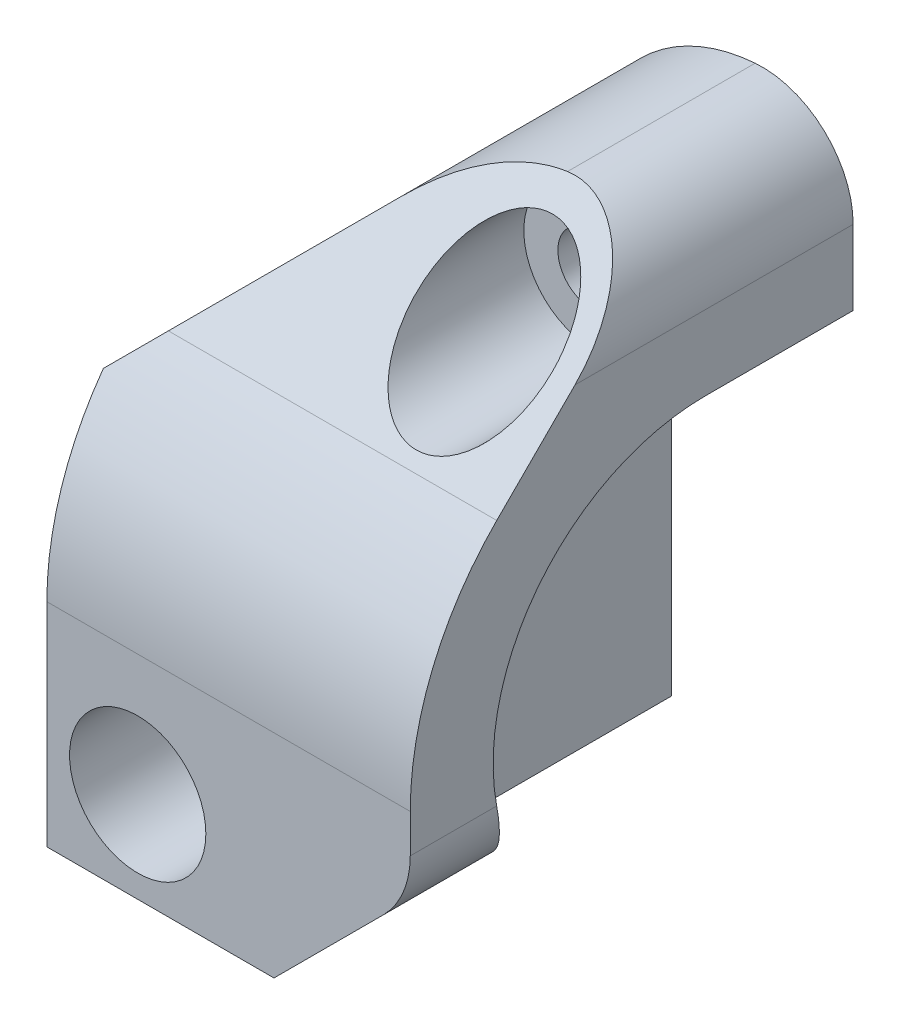
ISO-10303-21;
HEADER;
FILE_DESCRIPTION(('STEP AP214'),'2;1');
FILE_NAME('part.step','',(''),(''),'','','');
FILE_SCHEMA(('AUTOMOTIVE_DESIGN { 1 0 10303 214 1 1 1 1 }'));
ENDSEC;
DATA;
#1=APPLICATION_CONTEXT('core data for automotive mechanical design processes');
#2=APPLICATION_PROTOCOL_DEFINITION('international standard','automotive_design',2000,#1);
#3=PRODUCT_CONTEXT('',#1,'mechanical');
#4=PRODUCT('Part','Part','',(#3));
#5=PRODUCT_RELATED_PRODUCT_CATEGORY('part','',(#4));
#6=PRODUCT_DEFINITION_FORMATION('','',#4);
#7=PRODUCT_DEFINITION_CONTEXT('part definition',#1,'design');
#8=PRODUCT_DEFINITION('design','',#6,#7);
#9=PRODUCT_DEFINITION_SHAPE('','',#8);
#10=(LENGTH_UNIT() NAMED_UNIT(*) SI_UNIT(.MILLI.,.METRE.));
#11=(NAMED_UNIT(*) PLANE_ANGLE_UNIT() SI_UNIT($,.RADIAN.));
#12=(NAMED_UNIT(*) SI_UNIT($,.STERADIAN.) SOLID_ANGLE_UNIT());
#13=UNCERTAINTY_MEASURE_WITH_UNIT(LENGTH_MEASURE(1.E-05),#10,'distance_accuracy_value','');
#14=(GEOMETRIC_REPRESENTATION_CONTEXT(3) GLOBAL_UNCERTAINTY_ASSIGNED_CONTEXT((#13)) GLOBAL_UNIT_ASSIGNED_CONTEXT((#10,
#11,#12)) REPRESENTATION_CONTEXT('',''));
#15=CARTESIAN_POINT('',(0.,0.,0.));
#16=DIRECTION('',(0.,0.,1.));
#17=DIRECTION('',(1.,0.,0.));
#18=AXIS2_PLACEMENT_3D('',#15,#16,#17);
#19=CARTESIAN_POINT('',(0.,0.,8.5));
#20=DIRECTION('',(0.,0.,1.));
#21=DIRECTION('',(1.,0.,0.));
#22=AXIS2_PLACEMENT_3D('',#19,#20,#21);
#23=PLANE('',#22);
#24=CARTESIAN_POINT('',(79.,22.,8.5));
#25=DIRECTION('',(0.,0.,1.));
#26=DIRECTION('',(1.,0.,0.));
#27=AXIS2_PLACEMENT_3D('',#24,#25,#26);
#28=CIRCLE('',#27,1.49999999999999);
#29=CARTESIAN_POINT('',(80.5,22.,8.5));
#30=VERTEX_POINT('',#29);
#31=EDGE_CURVE('E269',#30,#30,#28,.F.);
#32=ORIENTED_EDGE('',*,*,#31,.F.);
#33=EDGE_LOOP('',(#32));
#34=FACE_BOUND('',#33,.T.);
#35=CARTESIAN_POINT('',(71.,4.,8.5));
#36=DIRECTION('',(0.,0.,1.));
#37=DIRECTION('',(1.,0.,0.));
#38=AXIS2_PLACEMENT_3D('',#35,#36,#37);
#39=CIRCLE('',#38,1.49999999999999);
#40=CARTESIAN_POINT('',(72.5,4.,8.5));
#41=VERTEX_POINT('',#40);
#42=EDGE_CURVE('E275',#41,#41,#39,.F.);
#43=ORIENTED_EDGE('',*,*,#42,.F.);
#44=EDGE_LOOP('',(#43));
#45=FACE_BOUND('',#44,.T.);
#46=CARTESIAN_POINT('',(79.3137084989848,18.,8.5));
#47=DIRECTION('',(0.,0.,1.));
#48=DIRECTION('',(1.,0.,0.));
#49=AXIS2_PLACEMENT_3D('',#46,#47,#48);
#50=CIRCLE('',#49,8.);
#51=CARTESIAN_POINT('',(73.6568542494924,23.6568542494924,8.5));
#52=VERTEX_POINT('',#51);
#53=CARTESIAN_POINT('',(78.6862915010153,25.975358795105,8.5));
#54=VERTEX_POINT('',#53);
#55=EDGE_CURVE('E253',#52,#54,#50,.F.);
#56=ORIENTED_EDGE('',*,*,#55,.T.);
#57=CARTESIAN_POINT('',(79.,21.9876793975525,8.5));
#58=DIRECTION('',(0.,0.,1.));
#59=DIRECTION('',(1.,0.,0.));
#60=AXIS2_PLACEMENT_3D('',#57,#58,#59);
#61=CIRCLE('',#60,4.);
#62=CARTESIAN_POINT('',(83.,21.9876793975525,8.5));
#63=VERTEX_POINT('',#62);
#64=EDGE_CURVE('E287',#54,#63,#61,.F.);
#65=ORIENTED_EDGE('',*,*,#64,.T.);
#66=DIRECTION('',(0.,-1.,0.));
#67=VECTOR('',#66,1.);
#68=CARTESIAN_POINT('',(83.,0.,8.5));
#69=LINE('',#68,#67);
#70=CARTESIAN_POINT('',(83.,18.7,8.5));
#71=VERTEX_POINT('',#70);
#72=EDGE_CURVE('E266',#63,#71,#69,.T.);
#73=ORIENTED_EDGE('',*,*,#72,.T.);
#74=DIRECTION('',(1.,0.,0.));
#75=VECTOR('',#74,1.);
#76=CARTESIAN_POINT('',(117.188302092967,18.7,8.5));
#77=LINE('',#76,#75);
#78=CARTESIAN_POINT('',(75.,18.7,8.5));
#79=VERTEX_POINT('',#78);
#80=EDGE_CURVE('E252',#79,#71,#77,.T.);
#81=ORIENTED_EDGE('',*,*,#80,.F.);
#82=DIRECTION('',(0.,-1.,0.));
#83=VECTOR('',#82,1.);
#84=CARTESIAN_POINT('',(75.,21.,8.5));
#85=LINE('',#84,#83);
#86=CARTESIAN_POINT('',(75.,0.,8.5));
#87=VERTEX_POINT('',#86);
#88=EDGE_CURVE('E261',#79,#87,#85,.T.);
#89=ORIENTED_EDGE('',*,*,#88,.T.);
#90=DIRECTION('',(-1.,0.,0.));
#91=VECTOR('',#90,1.);
#92=CARTESIAN_POINT('',(117.188302092967,0.,8.5));
#93=LINE('',#92,#91);
#94=CARTESIAN_POINT('',(67.,0.,8.5));
#95=VERTEX_POINT('',#94);
#96=EDGE_CURVE('E265',#87,#95,#93,.T.);
#97=ORIENTED_EDGE('',*,*,#96,.T.);
#98=DIRECTION('',(0.,1.,0.));
#99=VECTOR('',#98,1.);
#100=CARTESIAN_POINT('',(67.,0.,8.5));
#101=LINE('',#100,#99);
#102=CARTESIAN_POINT('',(67.,17.,8.5));
#103=VERTEX_POINT('',#102);
#104=EDGE_CURVE('E262',#95,#103,#101,.T.);
#105=ORIENTED_EDGE('',*,*,#104,.T.);
#106=DIRECTION('',(-0.707106781186549,-0.707106781186546,0.));
#107=VECTOR('',#106,1.);
#108=CARTESIAN_POINT('',(67.,17.,8.5));
#109=LINE('',#108,#107);
#110=EDGE_CURVE('E257',#103,#52,#109,.F.);
#111=ORIENTED_EDGE('',*,*,#110,.T.);
#112=EDGE_LOOP('',(#56,#65,#73,#81,#89,#97,#105,#111));
#113=FACE_BOUND('',#112,.T.);
#114=ADVANCED_FACE('F44',(#34,#45,#113),#23,.F.);
#115=CARTESIAN_POINT('',(79.,22.,2.));
#116=DIRECTION('',(0.,0.,-1.));
#117=DIRECTION('',(-1.,0.,0.));
#118=AXIS2_PLACEMENT_3D('',#115,#116,#117);
#119=CYLINDRICAL_SURFACE('',#118,1.49999999999999);
#120=ORIENTED_EDGE('',*,*,#31,.T.);
#121=EDGE_LOOP('',(#120));
#122=FACE_BOUND('',#121,.T.);
#123=CARTESIAN_POINT('',(79.,22.,16.));
#124=DIRECTION('',(0.,0.,1.));
#125=DIRECTION('',(1.,0.,0.));
#126=AXIS2_PLACEMENT_3D('',#123,#124,#125);
#127=CIRCLE('',#126,1.49999999999999);
#128=CARTESIAN_POINT('',(80.5,22.,16.));
#129=VERTEX_POINT('',#128);
#130=EDGE_CURVE('E231',#129,#129,#127,.F.);
#131=ORIENTED_EDGE('',*,*,#130,.F.);
#132=EDGE_LOOP('',(#131));
#133=FACE_BOUND('',#132,.T.);
#134=ADVANCED_FACE('F343',(#122,#133),#119,.F.);
#135=CARTESIAN_POINT('',(71.,4.,2.));
#136=DIRECTION('',(0.,0.,-1.));
#137=DIRECTION('',(-1.,0.,0.));
#138=AXIS2_PLACEMENT_3D('',#135,#136,#137);
#139=CYLINDRICAL_SURFACE('',#138,1.49999999999999);
#140=ORIENTED_EDGE('',*,*,#42,.T.);
#141=EDGE_LOOP('',(#140));
#142=FACE_BOUND('',#141,.T.);
#143=CARTESIAN_POINT('',(71.,4.,16.));
#144=DIRECTION('',(0.,0.,1.));
#145=DIRECTION('',(1.,0.,0.));
#146=AXIS2_PLACEMENT_3D('',#143,#144,#145);
#147=CIRCLE('',#146,1.49999999999999);
#148=CARTESIAN_POINT('',(72.5,4.,16.));
#149=VERTEX_POINT('',#148);
#150=EDGE_CURVE('E227',#149,#149,#147,.F.);
#151=ORIENTED_EDGE('',*,*,#150,.F.);
#152=EDGE_LOOP('',(#151));
#153=FACE_BOUND('',#152,.T.);
#154=ADVANCED_FACE('F330',(#142,#153),#139,.F.);
#155=CARTESIAN_POINT('',(83.,0.,0.));
#156=DIRECTION('',(1.,0.,0.));
#157=DIRECTION('',(0.,0.,-1.));
#158=AXIS2_PLACEMENT_3D('',#155,#156,#157);
#159=PLANE('',#158);
#160=DIRECTION('',(0.,1.,0.));
#161=VECTOR('',#160,1.);
#162=CARTESIAN_POINT('',(83.,0.,28.));
#163=LINE('',#162,#161);
#164=CARTESIAN_POINT('',(83.,7.6568542494924,28.));
#165=VERTEX_POINT('',#164);
#166=CARTESIAN_POINT('',(83.,9.34999999999999,28.));
#167=VERTEX_POINT('',#166);
#168=EDGE_CURVE('E192',#165,#167,#163,.T.);
#169=ORIENTED_EDGE('',*,*,#168,.F.);
#170=DIRECTION('',(0.,0.,1.));
#171=VECTOR('',#170,1.);
#172=CARTESIAN_POINT('',(83.,7.6568542494924,0.));
#173=LINE('',#172,#171);
#174=CARTESIAN_POINT('',(83.,7.6568542494924,24.1954204617047));
#175=VERTEX_POINT('',#174);
#176=EDGE_CURVE('E303',#165,#175,#173,.F.);
#177=ORIENTED_EDGE('',*,*,#176,.T.);
#178=CARTESIAN_POINT('',(83.,9.34999999999999,15.));
#179=DIRECTION('',(1.,0.,0.));
#180=DIRECTION('',(0.,0.,-1.));
#181=AXIS2_PLACEMENT_3D('',#178,#179,#180);
#182=CIRCLE('',#181,9.35);
#183=CARTESIAN_POINT('',(83.,18.7,15.));
#184=VERTEX_POINT('',#183);
#185=EDGE_CURVE('E195',#184,#175,#182,.T.);
#186=ORIENTED_EDGE('',*,*,#185,.F.);
#187=DIRECTION('',(0.,0.,-1.));
#188=VECTOR('',#187,1.);
#189=CARTESIAN_POINT('',(83.,18.7,15.));
#190=LINE('',#189,#188);
#191=EDGE_CURVE('E190',#184,#71,#190,.T.);
#192=ORIENTED_EDGE('',*,*,#191,.T.);
#193=ORIENTED_EDGE('',*,*,#72,.F.);
#194=DIRECTION('',(0.,0.,-1.));
#195=VECTOR('',#194,1.);
#196=CARTESIAN_POINT('',(83.,21.9876793975525,0.));
#197=LINE('',#196,#195);
#198=CARTESIAN_POINT('',(83.,21.9876793975525,20.7470969132977));
#199=VERTEX_POINT('',#198);
#200=EDGE_CURVE('E178',#63,#199,#197,.F.);
#201=ORIENTED_EDGE('',*,*,#200,.T.);
#202=DIRECTION('',(0.,0.707106781186549,-0.707106781186546));
#203=VECTOR('',#202,1.);
#204=CARTESIAN_POINT('',(83.,21.3673881554251,21.3673881554252));
#205=LINE('',#204,#203);
#206=CARTESIAN_POINT('',(83.,18.5423881554251,24.1923881554251));
#207=VERTEX_POINT('',#206);
#208=EDGE_CURVE('E165',#207,#199,#205,.T.);
#209=ORIENTED_EDGE('',*,*,#208,.F.);
#210=CARTESIAN_POINT('',(83.,9.34999999999999,15.));
#211=DIRECTION('',(1.,0.,0.));
#212=DIRECTION('',(0.,0.,-1.));
#213=AXIS2_PLACEMENT_3D('',#210,#211,#212);
#214=CIRCLE('',#213,13.);
#215=EDGE_CURVE('E154',#167,#207,#214,.F.);
#216=ORIENTED_EDGE('',*,*,#215,.F.);
#217=EDGE_LOOP('',(#169,#177,#186,#192,#193,#201,#209,#216));
#218=FACE_BOUND('',#217,.T.);
#219=ADVANCED_FACE('F175',(#218),#159,.T.);
#220=CARTESIAN_POINT('',(67.,0.,40.));
#221=DIRECTION('',(-1.,0.,0.));
#222=DIRECTION('',(0.,0.,1.));
#223=AXIS2_PLACEMENT_3D('',#220,#221,#222);
#224=PLANE('',#223);
#225=ORIENTED_EDGE('',*,*,#104,.F.);
#226=DIRECTION('',(0.,0.,-1.));
#227=VECTOR('',#226,1.);
#228=CARTESIAN_POINT('',(67.,0.,40.));
#229=LINE('',#228,#227);
#230=CARTESIAN_POINT('',(67.,0.,28.));
#231=VERTEX_POINT('',#230);
#232=EDGE_CURVE('E185',#231,#95,#229,.T.);
#233=ORIENTED_EDGE('',*,*,#232,.F.);
#234=DIRECTION('',(0.,-1.,0.));
#235=VECTOR('',#234,1.);
#236=CARTESIAN_POINT('',(67.,0.,28.));
#237=LINE('',#236,#235);
#238=CARTESIAN_POINT('',(67.,9.34999999999999,28.));
#239=VERTEX_POINT('',#238);
#240=EDGE_CURVE('E223',#239,#231,#237,.T.);
#241=ORIENTED_EDGE('',*,*,#240,.F.);
#242=CARTESIAN_POINT('',(67.,9.34999999999999,15.));
#243=DIRECTION('',(-1.,0.,0.));
#244=DIRECTION('',(0.,0.,1.));
#245=AXIS2_PLACEMENT_3D('',#242,#243,#244);
#246=CIRCLE('',#245,13.);
#247=CARTESIAN_POINT('',(67.,17.,25.5108277504676));
#248=VERTEX_POINT('',#247);
#249=EDGE_CURVE('E218',#248,#239,#246,.F.);
#250=ORIENTED_EDGE('',*,*,#249,.F.);
#251=DIRECTION('',(0.,0.,-1.));
#252=VECTOR('',#251,1.);
#253=CARTESIAN_POINT('',(67.,17.,40.));
#254=LINE('',#253,#252);
#255=EDGE_CURVE('E226',#248,#103,#254,.T.);
#256=ORIENTED_EDGE('',*,*,#255,.T.);
#257=EDGE_LOOP('',(#225,#233,#241,#250,#256));
#258=FACE_BOUND('',#257,.T.);
#259=ADVANCED_FACE('F325',(#258),#224,.T.);
#260=CARTESIAN_POINT('',(117.188302092967,0.,28.));
#261=DIRECTION('',(0.,0.,1.));
#262=DIRECTION('',(0.,-1.,0.));
#263=AXIS2_PLACEMENT_3D('',#260,#261,#262);
#264=PLANE('',#263);
#265=CARTESIAN_POINT('',(71.,4.,28.));
#266=DIRECTION('',(0.,0.,1.));
#267=DIRECTION('',(1.,0.,0.));
#268=AXIS2_PLACEMENT_3D('',#265,#266,#267);
#269=CIRCLE('',#268,3.00000000000001);
#270=CARTESIAN_POINT('',(74.,4.,28.));
#271=VERTEX_POINT('',#270);
#272=EDGE_CURVE('E376',#271,#271,#269,.T.);
#273=ORIENTED_EDGE('',*,*,#272,.F.);
#274=EDGE_LOOP('',(#273));
#275=FACE_BOUND('',#274,.T.);
#276=DIRECTION('',(-0.707106781186546,-0.707106781186549,0.));
#277=VECTOR('',#276,1.);
#278=CARTESIAN_POINT('',(97.0941510464836,20.0941510464837,28.));
#279=LINE('',#278,#277);
#280=CARTESIAN_POINT('',(77.,0.,28.));
#281=VERTEX_POINT('',#280);
#282=CARTESIAN_POINT('',(81.8284271247462,4.82842712474622,28.));
#283=VERTEX_POINT('',#282);
#284=EDGE_CURVE('E297',#281,#283,#279,.F.);
#285=ORIENTED_EDGE('',*,*,#284,.T.);
#286=CARTESIAN_POINT('',(79.,7.6568542494924,28.));
#287=DIRECTION('',(0.,0.,1.));
#288=DIRECTION('',(0.,-1.,0.));
#289=AXIS2_PLACEMENT_3D('',#286,#287,#288);
#290=CIRCLE('',#289,4.);
#291=EDGE_CURVE('E12',#283,#165,#290,.T.);
#292=ORIENTED_EDGE('',*,*,#291,.T.);
#293=ORIENTED_EDGE('',*,*,#168,.T.);
#294=DIRECTION('',(-1.,0.,0.));
#295=VECTOR('',#294,1.);
#296=CARTESIAN_POINT('',(98.,9.34999999999999,28.));
#297=LINE('',#296,#295);
#298=EDGE_CURVE('E160',#167,#239,#297,.T.);
#299=ORIENTED_EDGE('',*,*,#298,.T.);
#300=ORIENTED_EDGE('',*,*,#240,.T.);
#301=DIRECTION('',(-1.,0.,0.));
#302=VECTOR('',#301,1.);
#303=CARTESIAN_POINT('',(117.188302092967,0.,28.));
#304=LINE('',#303,#302);
#305=EDGE_CURVE('E204',#281,#231,#304,.T.);
#306=ORIENTED_EDGE('',*,*,#305,.F.);
#307=EDGE_LOOP('',(#285,#292,#293,#299,#300,#306));
#308=FACE_BOUND('',#307,.T.);
#309=ADVANCED_FACE('F321',(#275,#308),#264,.T.);
#310=CARTESIAN_POINT('',(117.188302092967,18.7,15.));
#311=DIRECTION('',(0.,1.,0.));
#312=DIRECTION('',(0.,0.,1.));
#313=AXIS2_PLACEMENT_3D('',#310,#311,#312);
#314=PLANE('',#313);
#315=DIRECTION('',(0.,0.,-1.));
#316=VECTOR('',#315,1.);
#317=CARTESIAN_POINT('',(75.,18.7,15.));
#318=LINE('',#317,#316);
#319=CARTESIAN_POINT('',(75.,18.7,15.));
#320=VERTEX_POINT('',#319);
#321=EDGE_CURVE('E213',#320,#79,#318,.T.);
#322=ORIENTED_EDGE('',*,*,#321,.T.);
#323=ORIENTED_EDGE('',*,*,#80,.T.);
#324=ORIENTED_EDGE('',*,*,#191,.F.);
#325=DIRECTION('',(-1.,0.,0.));
#326=VECTOR('',#325,1.);
#327=CARTESIAN_POINT('',(117.188302092967,18.7,15.));
#328=LINE('',#327,#326);
#329=EDGE_CURVE('E194',#184,#320,#328,.T.);
#330=ORIENTED_EDGE('',*,*,#329,.T.);
#331=EDGE_LOOP('',(#322,#323,#324,#330));
#332=FACE_BOUND('',#331,.T.);
#333=ADVANCED_FACE('F317',(#332),#314,.F.);
#334=CARTESIAN_POINT('',(117.188302092967,9.34999999999999,15.));
#335=DIRECTION('',(-1.,0.,0.));
#336=DIRECTION('',(0.,0.,1.));
#337=AXIS2_PLACEMENT_3D('',#334,#335,#336);
#338=CYLINDRICAL_SURFACE('',#337,9.35);
#339=ORIENTED_EDGE('',*,*,#185,.T.);
#340=CARTESIAN_POINT('',(83.,7.6568542494924,24.1954204617047));
#341=CARTESIAN_POINT('',(83.0000148130088,7.54374262795202,24.1746132141727));
#342=CARTESIAN_POINT('',(82.9952030674036,7.43105018359627,24.151686246753));
#343=CARTESIAN_POINT('',(82.9762474170669,7.20739746160415,24.1019104561758));
#344=CARTESIAN_POINT('',(82.9621092336969,7.09643616467687,24.0750640452828));
#345=CARTESIAN_POINT('',(82.924888105756,6.87739432780631,24.0178440071178));
#346=CARTESIAN_POINT('',(82.9018375836133,6.76930484644043,23.9874834414062));
#347=CARTESIAN_POINT('',(82.8471897732038,6.55629524858096,23.9235697287888));
#348=CARTESIAN_POINT('',(82.815591541333,6.45137548342295,23.890016229672));
#349=CARTESIAN_POINT('',(82.7087565836882,6.142793412097,23.785401485751));
#350=CARTESIAN_POINT('',(82.6213582239986,5.94461595898291,23.7102017480297));
#351=CARTESIAN_POINT('',(82.4173898059137,5.56698441756775,23.5529645565063));
#352=CARTESIAN_POINT('',(82.3008188971419,5.38753087528261,23.4709269034261));
#353=CARTESIAN_POINT('',(82.1182571632292,5.15006037801996,23.3539765186816));
#354=CARTESIAN_POINT('',(82.0631586690767,5.08302605841993,23.31990668868));
#355=CARTESIAN_POINT('',(81.9488593827251,4.95283827259731,23.2518389395797));
#356=CARTESIAN_POINT('',(81.8896686615258,4.88967595338198,23.2178410422237));
#357=CARTESIAN_POINT('',(81.8284271247462,4.82842712474622,23.1840013889154));
#358=B_SPLINE_CURVE_WITH_KNOTS('',3,(#340,#341,#342,#343,#344,#345,#346,#347,#348,#349,#350,
#351,#352,#353,#354,#355,#356,#357),.UNSPECIFIED.,.F.,.F.,(4,2,2,2,2,2,2,2,4),(0.,
0.344864243351805,0.689517124070927,1.03292780453954,1.37637641048363,2.06112045717537,
2.74588446640192,3.02541048789719,3.30427153011367),.UNSPECIFIED.);
#359=CARTESIAN_POINT('',(81.8284271247462,4.82842712474622,23.1840013889154));
#360=VERTEX_POINT('',#359);
#361=EDGE_CURVE('E67',#175,#360,#358,.T.);
#362=ORIENTED_EDGE('',*,*,#361,.T.);
#363=CARTESIAN_POINT('',(86.35,9.34999999999999,15.));
#364=DIRECTION('',(-0.707106781186549,0.707106781186546,0.));
#365=DIRECTION('',(-0.707106781186546,-0.707106781186549,0.));
#366=AXIS2_PLACEMENT_3D('',#363,#364,#365);
#367=ELLIPSE('',#366,13.2228968081884,9.35);
#368=CARTESIAN_POINT('',(80.57072668928,3.57072668928003,22.35));
#369=VERTEX_POINT('',#368);
#370=EDGE_CURVE('E299',#360,#369,#367,.F.);
#371=ORIENTED_EDGE('',*,*,#370,.T.);
#372=DIRECTION('',(-1.,0.,0.));
#373=VECTOR('',#372,1.);
#374=CARTESIAN_POINT('',(117.188302092967,3.57072668928003,22.35));
#375=LINE('',#374,#373);
#376=CARTESIAN_POINT('',(75.,3.57072668928003,22.35));
#377=VERTEX_POINT('',#376);
#378=EDGE_CURVE('E198',#369,#377,#375,.T.);
#379=ORIENTED_EDGE('',*,*,#378,.T.);
#380=CARTESIAN_POINT('',(75.,9.34999999999999,15.));
#381=DIRECTION('',(1.,0.,0.));
#382=DIRECTION('',(0.,0.,-1.));
#383=AXIS2_PLACEMENT_3D('',#380,#381,#382);
#384=CIRCLE('',#383,9.35);
#385=EDGE_CURVE('E214',#320,#377,#384,.T.);
#386=ORIENTED_EDGE('',*,*,#385,.F.);
#387=ORIENTED_EDGE('',*,*,#329,.F.);
#388=EDGE_LOOP('',(#339,#362,#371,#379,#386,#387));
#389=FACE_BOUND('',#388,.T.);
#390=ADVANCED_FACE('F311',(#389),#338,.F.);
#391=CARTESIAN_POINT('',(117.188302092967,0.,22.35));
#392=DIRECTION('',(0.,0.,1.));
#393=DIRECTION('',(1.,0.,0.));
#394=AXIS2_PLACEMENT_3D('',#391,#392,#393);
#395=PLANE('',#394);
#396=ORIENTED_EDGE('',*,*,#378,.F.);
#397=DIRECTION('',(0.707106781186546,0.707106781186549,0.));
#398=VECTOR('',#397,1.);
#399=CARTESIAN_POINT('',(77.,0.,22.35));
#400=LINE('',#399,#398);
#401=CARTESIAN_POINT('',(77.,0.,22.35));
#402=VERTEX_POINT('',#401);
#403=EDGE_CURVE('E301',#369,#402,#400,.F.);
#404=ORIENTED_EDGE('',*,*,#403,.T.);
#405=DIRECTION('',(-1.,0.,0.));
#406=VECTOR('',#405,1.);
#407=CARTESIAN_POINT('',(117.188302092967,0.,22.35));
#408=LINE('',#407,#406);
#409=CARTESIAN_POINT('',(75.,0.,22.35));
#410=VERTEX_POINT('',#409);
#411=EDGE_CURVE('E202',#402,#410,#408,.T.);
#412=ORIENTED_EDGE('',*,*,#411,.T.);
#413=DIRECTION('',(0.,1.,0.));
#414=VECTOR('',#413,1.);
#415=CARTESIAN_POINT('',(75.,0.,22.35));
#416=LINE('',#415,#414);
#417=EDGE_CURVE('E210',#410,#377,#416,.T.);
#418=ORIENTED_EDGE('',*,*,#417,.T.);
#419=EDGE_LOOP('',(#396,#404,#412,#418));
#420=FACE_BOUND('',#419,.T.);
#421=ADVANCED_FACE('F316',(#420),#395,.F.);
#422=CARTESIAN_POINT('',(117.188302092967,0.,22.35));
#423=DIRECTION('',(0.,-1.,0.));
#424=DIRECTION('',(0.,0.,-1.));
#425=AXIS2_PLACEMENT_3D('',#422,#423,#424);
#426=PLANE('',#425);
#427=ORIENTED_EDGE('',*,*,#411,.F.);
#428=DIRECTION('',(0.,0.,1.));
#429=VECTOR('',#428,1.);
#430=CARTESIAN_POINT('',(77.,0.,22.35));
#431=LINE('',#430,#429);
#432=EDGE_CURVE('E294',#402,#281,#431,.T.);
#433=ORIENTED_EDGE('',*,*,#432,.T.);
#434=ORIENTED_EDGE('',*,*,#305,.T.);
#435=ORIENTED_EDGE('',*,*,#232,.T.);
#436=ORIENTED_EDGE('',*,*,#96,.F.);
#437=DIRECTION('',(0.,0.,-1.));
#438=VECTOR('',#437,1.);
#439=CARTESIAN_POINT('',(75.,0.,40.));
#440=LINE('',#439,#438);
#441=EDGE_CURVE('E180',#410,#87,#440,.T.);
#442=ORIENTED_EDGE('',*,*,#441,.F.);
#443=EDGE_LOOP('',(#427,#433,#434,#435,#436,#442));
#444=FACE_BOUND('',#443,.T.);
#445=ADVANCED_FACE('F410',(#444),#426,.T.);
#446=CARTESIAN_POINT('',(75.,21.,40.));
#447=DIRECTION('',(1.,0.,0.));
#448=DIRECTION('',(0.,0.,-1.));
#449=AXIS2_PLACEMENT_3D('',#446,#447,#448);
#450=PLANE('',#449);
#451=ORIENTED_EDGE('',*,*,#88,.F.);
#452=ORIENTED_EDGE('',*,*,#321,.F.);
#453=ORIENTED_EDGE('',*,*,#385,.T.);
#454=ORIENTED_EDGE('',*,*,#417,.F.);
#455=ORIENTED_EDGE('',*,*,#441,.T.);
#456=EDGE_LOOP('',(#451,#452,#453,#454,#455));
#457=FACE_BOUND('',#456,.T.);
#458=ADVANCED_FACE('F327',(#457),#450,.T.);
#459=CARTESIAN_POINT('',(98.,9.34999999999999,15.));
#460=DIRECTION('',(-1.,0.,0.));
#461=DIRECTION('',(0.,0.,1.));
#462=AXIS2_PLACEMENT_3D('',#459,#460,#461);
#463=CYLINDRICAL_SURFACE('',#462,13.);
#464=DIRECTION('',(-1.,0.,0.));
#465=VECTOR('',#464,1.);
#466=CARTESIAN_POINT('',(98.,18.5423881554251,24.1923881554251));
#467=LINE('',#466,#465);
#468=CARTESIAN_POINT('',(68.5423881554251,18.5423881554251,24.1923881554251));
#469=VERTEX_POINT('',#468);
#470=EDGE_CURVE('E157',#207,#469,#467,.T.);
#471=ORIENTED_EDGE('',*,*,#470,.T.);
#472=CARTESIAN_POINT('',(59.35,9.34999999999999,15.));
#473=DIRECTION('',(0.707106781186546,-0.707106781186549,0.));
#474=DIRECTION('',(-0.707106781186549,-0.707106781186546,0.));
#475=AXIS2_PLACEMENT_3D('',#472,#473,#474);
#476=ELLIPSE('',#475,18.3847763108503,13.);
#477=EDGE_CURVE('E243',#469,#248,#476,.T.);
#478=ORIENTED_EDGE('',*,*,#477,.T.);
#479=ORIENTED_EDGE('',*,*,#249,.T.);
#480=ORIENTED_EDGE('',*,*,#298,.F.);
#481=ORIENTED_EDGE('',*,*,#215,.T.);
#482=EDGE_LOOP('',(#471,#478,#479,#480,#481));
#483=FACE_BOUND('',#482,.T.);
#484=ADVANCED_FACE('F156',(#483),#463,.T.);
#485=CARTESIAN_POINT('',(98.,18.5423881554251,24.1923881554251));
#486=DIRECTION('',(0.,-0.707106781186546,-0.707106781186549));
#487=DIRECTION('',(0.,0.707106781186549,-0.707106781186546));
#488=AXIS2_PLACEMENT_3D('',#485,#486,#487);
#489=PLANE('',#488);
#490=CARTESIAN_POINT('',(79.,22.,20.7347763108502));
#491=DIRECTION('',(0.,-0.707106781186546,-0.707106781186549));
#492=DIRECTION('',(0.,-0.707106781186549,0.707106781186546));
#493=AXIS2_PLACEMENT_3D('',#490,#491,#492);
#494=ELLIPSE('',#493,4.24264068711929,3.00000000000001);
#495=CARTESIAN_POINT('',(79.,19.,23.7347763108502));
#496=VERTEX_POINT('',#495);
#497=EDGE_CURVE('E236',#496,#496,#494,.T.);
#498=ORIENTED_EDGE('',*,*,#497,.T.);
#499=EDGE_LOOP('',(#498));
#500=FACE_BOUND('',#499,.T.);
#501=ORIENTED_EDGE('',*,*,#208,.T.);
#502=CARTESIAN_POINT('',(79.,21.9876793975525,20.7470969132977));
#503=DIRECTION('',(0.,-0.707106781186546,-0.707106781186549));
#504=DIRECTION('',(0.,0.707106781186549,-0.707106781186546));
#505=AXIS2_PLACEMENT_3D('',#502,#503,#504);
#506=ELLIPSE('',#505,5.65685424949237,4.);
#507=CARTESIAN_POINT('',(78.6862915010153,25.975358795105,16.7594175157452));
#508=VERTEX_POINT('',#507);
#509=EDGE_CURVE('E292',#199,#508,#506,.F.);
#510=ORIENTED_EDGE('',*,*,#509,.T.);
#511=CARTESIAN_POINT('',(79.3137084989848,18.,24.7347763108502));
#512=DIRECTION('',(0.,-0.707106781186546,-0.707106781186549));
#513=DIRECTION('',(0.,0.707106781186549,-0.707106781186546));
#514=AXIS2_PLACEMENT_3D('',#511,#512,#513);
#515=ELLIPSE('',#514,11.3137084989847,8.);
#516=CARTESIAN_POINT('',(73.6568542494924,23.6568542494924,19.0779220613579));
#517=VERTEX_POINT('',#516);
#518=EDGE_CURVE('E245',#508,#517,#515,.F.);
#519=ORIENTED_EDGE('',*,*,#518,.T.);
#520=DIRECTION('',(0.577350269189628,0.577350269189626,-0.577350269189624));
#521=VECTOR('',#520,1.);
#522=CARTESIAN_POINT('',(62.2449254369501,12.2449254369501,30.4898508739001));
#523=LINE('',#522,#521);
#524=EDGE_CURVE('E172',#517,#469,#523,.F.);
#525=ORIENTED_EDGE('',*,*,#524,.T.);
#526=ORIENTED_EDGE('',*,*,#470,.F.);
#527=EDGE_LOOP('',(#501,#510,#519,#525,#526));
#528=FACE_BOUND('',#527,.T.);
#529=ADVANCED_FACE('F169',(#500,#528),#489,.F.);
#530=CARTESIAN_POINT('',(71.,4.,16.));
#531=DIRECTION('',(0.,0.,1.));
#532=DIRECTION('',(1.,0.,0.));
#533=AXIS2_PLACEMENT_3D('',#530,#531,#532);
#534=PLANE('',#533);
#535=CARTESIAN_POINT('',(71.,4.,16.));
#536=DIRECTION('',(0.,0.,1.));
#537=DIRECTION('',(1.,0.,0.));
#538=AXIS2_PLACEMENT_3D('',#535,#536,#537);
#539=CIRCLE('',#538,3.00000000000001);
#540=CARTESIAN_POINT('',(74.,4.,16.));
#541=VERTEX_POINT('',#540);
#542=EDGE_CURVE('E379',#541,#541,#539,.T.);
#543=ORIENTED_EDGE('',*,*,#542,.T.);
#544=EDGE_LOOP('',(#543));
#545=FACE_BOUND('',#544,.T.);
#546=ORIENTED_EDGE('',*,*,#150,.T.);
#547=EDGE_LOOP('',(#546));
#548=FACE_BOUND('',#547,.T.);
#549=ADVANCED_FACE('F397',(#545,#548),#534,.T.);
#550=CARTESIAN_POINT('',(71.,4.,16.));
#551=DIRECTION('',(0.,0.,1.));
#552=DIRECTION('',(1.,0.,0.));
#553=AXIS2_PLACEMENT_3D('',#550,#551,#552);
#554=CYLINDRICAL_SURFACE('',#553,3.00000000000001);
#555=ORIENTED_EDGE('',*,*,#542,.F.);
#556=EDGE_LOOP('',(#555));
#557=FACE_BOUND('',#556,.T.);
#558=ORIENTED_EDGE('',*,*,#272,.T.);
#559=EDGE_LOOP('',(#558));
#560=FACE_BOUND('',#559,.T.);
#561=ADVANCED_FACE('F392',(#557,#560),#554,.F.);
#562=CARTESIAN_POINT('',(79.,22.,16.));
#563=DIRECTION('',(0.,0.,1.));
#564=DIRECTION('',(1.,0.,0.));
#565=AXIS2_PLACEMENT_3D('',#562,#563,#564);
#566=CYLINDRICAL_SURFACE('',#565,3.00000000000001);
#567=CARTESIAN_POINT('',(79.,22.,16.));
#568=DIRECTION('',(0.,0.,1.));
#569=DIRECTION('',(1.,0.,0.));
#570=AXIS2_PLACEMENT_3D('',#567,#568,#569);
#571=CIRCLE('',#570,3.00000000000001);
#572=CARTESIAN_POINT('',(82.,22.,16.));
#573=VERTEX_POINT('',#572);
#574=EDGE_CURVE('E232',#573,#573,#571,.T.);
#575=ORIENTED_EDGE('',*,*,#574,.F.);
#576=EDGE_LOOP('',(#575));
#577=FACE_BOUND('',#576,.T.);
#578=ORIENTED_EDGE('',*,*,#497,.F.);
#579=EDGE_LOOP('',(#578));
#580=FACE_BOUND('',#579,.T.);
#581=ADVANCED_FACE('F389',(#577,#580),#566,.F.);
#582=CARTESIAN_POINT('',(79.,22.,16.));
#583=DIRECTION('',(0.,0.,1.));
#584=DIRECTION('',(1.,0.,0.));
#585=AXIS2_PLACEMENT_3D('',#582,#583,#584);
#586=PLANE('',#585);
#587=ORIENTED_EDGE('',*,*,#574,.T.);
#588=EDGE_LOOP('',(#587));
#589=FACE_BOUND('',#588,.T.);
#590=ORIENTED_EDGE('',*,*,#130,.T.);
#591=EDGE_LOOP('',(#590));
#592=FACE_BOUND('',#591,.T.);
#593=ADVANCED_FACE('F335',(#589,#592),#586,.T.);
#594=CARTESIAN_POINT('',(67.,17.,40.));
#595=DIRECTION('',(0.707106781186546,-0.707106781186549,0.));
#596=DIRECTION('',(0.,0.,-1.));
#597=AXIS2_PLACEMENT_3D('',#594,#595,#596);
#598=PLANE('',#597);
#599=ORIENTED_EDGE('',*,*,#110,.F.);
#600=ORIENTED_EDGE('',*,*,#255,.F.);
#601=ORIENTED_EDGE('',*,*,#477,.F.);
#602=ORIENTED_EDGE('',*,*,#524,.F.);
#603=DIRECTION('',(0.,0.,1.));
#604=VECTOR('',#603,1.);
#605=CARTESIAN_POINT('',(73.6568542494924,23.6568542494924,40.));
#606=LINE('',#605,#604);
#607=EDGE_CURVE('E248',#517,#52,#606,.F.);
#608=ORIENTED_EDGE('',*,*,#607,.T.);
#609=EDGE_LOOP('',(#599,#600,#601,#602,#608));
#610=FACE_BOUND('',#609,.T.);
#611=ADVANCED_FACE('F331',(#610),#598,.F.);
#612=CARTESIAN_POINT('',(79.3137084989848,18.,40.));
#613=DIRECTION('',(0.,0.,-1.));
#614=DIRECTION('',(-1.,0.,0.));
#615=AXIS2_PLACEMENT_3D('',#612,#613,#614);
#616=CYLINDRICAL_SURFACE('',#615,8.);
#617=ORIENTED_EDGE('',*,*,#518,.F.);
#618=DIRECTION('',(0.,0.,-1.));
#619=VECTOR('',#618,1.);
#620=CARTESIAN_POINT('',(78.6862915010153,25.975358795105,40.));
#621=LINE('',#620,#619);
#622=EDGE_CURVE('E256',#508,#54,#621,.T.);
#623=ORIENTED_EDGE('',*,*,#622,.T.);
#624=ORIENTED_EDGE('',*,*,#55,.F.);
#625=ORIENTED_EDGE('',*,*,#607,.F.);
#626=EDGE_LOOP('',(#617,#623,#624,#625));
#627=FACE_BOUND('',#626,.T.);
#628=ADVANCED_FACE('F334',(#627),#616,.T.);
#629=CARTESIAN_POINT('',(79.,21.9876793975525,40.));
#630=DIRECTION('',(0.,0.,-1.));
#631=DIRECTION('',(-1.,0.,0.));
#632=AXIS2_PLACEMENT_3D('',#629,#630,#631);
#633=CYLINDRICAL_SURFACE('',#632,4.);
#634=ORIENTED_EDGE('',*,*,#509,.F.);
#635=ORIENTED_EDGE('',*,*,#200,.F.);
#636=ORIENTED_EDGE('',*,*,#64,.F.);
#637=ORIENTED_EDGE('',*,*,#622,.F.);
#638=EDGE_LOOP('',(#634,#635,#636,#637));
#639=FACE_BOUND('',#638,.T.);
#640=ADVANCED_FACE('F339',(#639),#633,.T.);
#641=CARTESIAN_POINT('',(77.,0.,22.35));
#642=DIRECTION('',(-0.707106781186549,0.707106781186546,0.));
#643=DIRECTION('',(0.,0.,1.));
#644=AXIS2_PLACEMENT_3D('',#641,#642,#643);
#645=PLANE('',#644);
#646=ORIENTED_EDGE('',*,*,#370,.F.);
#647=DIRECTION('',(0.,0.,-1.));
#648=VECTOR('',#647,1.);
#649=CARTESIAN_POINT('',(81.8284271247462,4.82842712474622,22.35));
#650=LINE('',#649,#648);
#651=EDGE_CURVE('E53',#360,#283,#650,.F.);
#652=ORIENTED_EDGE('',*,*,#651,.T.);
#653=ORIENTED_EDGE('',*,*,#284,.F.);
#654=ORIENTED_EDGE('',*,*,#432,.F.);
#655=ORIENTED_EDGE('',*,*,#403,.F.);
#656=EDGE_LOOP('',(#646,#652,#653,#654,#655));
#657=FACE_BOUND('',#656,.T.);
#658=ADVANCED_FACE('F346',(#657),#645,.F.);
#659=CARTESIAN_POINT('',(79.,7.6568542494924,0.));
#660=DIRECTION('',(0.,0.,1.));
#661=DIRECTION('',(0.,-1.,0.));
#662=AXIS2_PLACEMENT_3D('',#659,#660,#661);
#663=CYLINDRICAL_SURFACE('',#662,4.);
#664=ORIENTED_EDGE('',*,*,#291,.F.);
#665=ORIENTED_EDGE('',*,*,#651,.F.);
#666=ORIENTED_EDGE('',*,*,#361,.F.);
#667=ORIENTED_EDGE('',*,*,#176,.F.);
#668=EDGE_LOOP('',(#664,#665,#666,#667));
#669=FACE_BOUND('',#668,.T.);
#670=ADVANCED_FACE('F46',(#669),#663,.T.);
#671=CLOSED_SHELL('',(#114,#134,#154,#219,#259,#309,#333,#390,#421,#445,#458,#484,#529,#549,
#561,#581,#593,#611,#628,#640,#658,#670));
#672=MANIFOLD_SOLID_BREP('B2',#671);
#673=ADVANCED_BREP_SHAPE_REPRESENTATION('',(#18,#672),#14);
#674=SHAPE_DEFINITION_REPRESENTATION(#9,#673);
ENDSEC;
END-ISO-10303-21;
